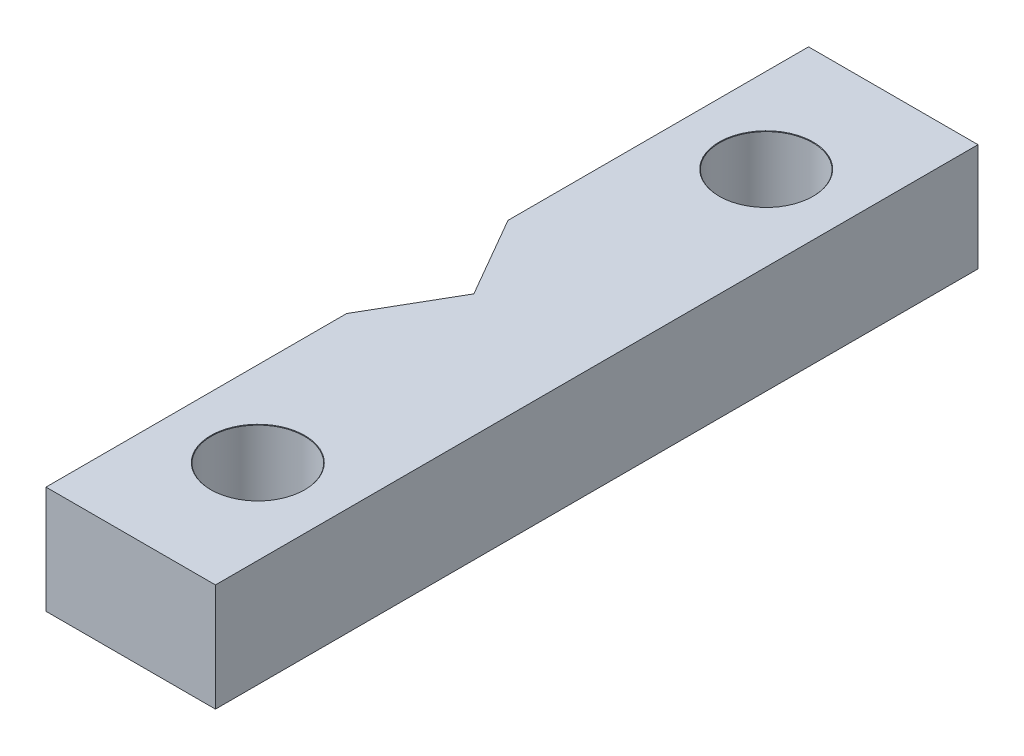
ISO-10303-21;
HEADER;
FILE_DESCRIPTION(('STEP AP214'),'2;1');
FILE_NAME('part.step','',(''),(''),'','','');
FILE_SCHEMA(('AUTOMOTIVE_DESIGN { 1 0 10303 214 1 1 1 1 }'));
ENDSEC;
DATA;
#1=APPLICATION_CONTEXT('core data for automotive mechanical design processes');
#2=APPLICATION_PROTOCOL_DEFINITION('international standard','automotive_design',2000,#1);
#3=PRODUCT_CONTEXT('',#1,'mechanical');
#4=PRODUCT('Part','Part','',(#3));
#5=PRODUCT_RELATED_PRODUCT_CATEGORY('part','',(#4));
#6=PRODUCT_DEFINITION_FORMATION('','',#4);
#7=PRODUCT_DEFINITION_CONTEXT('part definition',#1,'design');
#8=PRODUCT_DEFINITION('design','',#6,#7);
#9=PRODUCT_DEFINITION_SHAPE('','',#8);
#10=(LENGTH_UNIT() NAMED_UNIT(*) SI_UNIT(.MILLI.,.METRE.));
#11=(NAMED_UNIT(*) PLANE_ANGLE_UNIT() SI_UNIT($,.RADIAN.));
#12=(NAMED_UNIT(*) SI_UNIT($,.STERADIAN.) SOLID_ANGLE_UNIT());
#13=UNCERTAINTY_MEASURE_WITH_UNIT(LENGTH_MEASURE(1.E-05),#10,'distance_accuracy_value','');
#14=(GEOMETRIC_REPRESENTATION_CONTEXT(3) GLOBAL_UNCERTAINTY_ASSIGNED_CONTEXT((#13)) GLOBAL_UNIT_ASSIGNED_CONTEXT((#10,
#11,#12)) REPRESENTATION_CONTEXT('',''));
#15=CARTESIAN_POINT('',(0.,0.,0.));
#16=DIRECTION('',(0.,0.,1.));
#17=DIRECTION('',(1.,0.,0.));
#18=AXIS2_PLACEMENT_3D('',#15,#16,#17);
#19=CARTESIAN_POINT('',(10.7493713156446,6.35,0.));
#20=DIRECTION('',(1.,0.,0.));
#21=DIRECTION('',(0.,0.,-1.));
#22=AXIS2_PLACEMENT_3D('',#19,#20,#21);
#23=PLANE('',#22);
#24=DIRECTION('',(0.,0.,1.));
#25=VECTOR('',#24,1.);
#26=CARTESIAN_POINT('',(10.7493713156446,0.,0.));
#27=LINE('',#26,#25);
#28=CARTESIAN_POINT('',(10.7493713156446,0.,-22.5));
#29=VERTEX_POINT('',#28);
#30=CARTESIAN_POINT('',(10.7493713156446,0.,22.5));
#31=VERTEX_POINT('',#30);
#32=EDGE_CURVE('E134',#29,#31,#27,.T.);
#33=ORIENTED_EDGE('',*,*,#32,.F.);
#34=DIRECTION('',(0.,-1.,0.));
#35=VECTOR('',#34,1.);
#36=CARTESIAN_POINT('',(10.7493713156446,6.35,-22.5));
#37=LINE('',#36,#35);
#38=CARTESIAN_POINT('',(10.7493713156446,6.35,-22.5));
#39=VERTEX_POINT('',#38);
#40=EDGE_CURVE('E11',#39,#29,#37,.T.);
#41=ORIENTED_EDGE('',*,*,#40,.F.);
#42=DIRECTION('',(0.,0.,1.));
#43=VECTOR('',#42,1.);
#44=CARTESIAN_POINT('',(10.7493713156446,6.35,0.));
#45=LINE('',#44,#43);
#46=CARTESIAN_POINT('',(10.7493713156446,6.35,22.5));
#47=VERTEX_POINT('',#46);
#48=EDGE_CURVE('E152',#39,#47,#45,.T.);
#49=ORIENTED_EDGE('',*,*,#48,.T.);
#50=DIRECTION('',(0.,-1.,0.));
#51=VECTOR('',#50,1.);
#52=CARTESIAN_POINT('',(10.7493713156446,6.35,22.5));
#53=LINE('',#52,#51);
#54=EDGE_CURVE('E94',#47,#31,#53,.T.);
#55=ORIENTED_EDGE('',*,*,#54,.T.);
#56=EDGE_LOOP('',(#33,#41,#49,#55));
#57=FACE_BOUND('',#56,.T.);
#58=ADVANCED_FACE('F45',(#57),#23,.T.);
#59=CARTESIAN_POINT('',(0.,6.35,-22.5));
#60=DIRECTION('',(0.,0.,-1.));
#61=DIRECTION('',(-1.,0.,0.));
#62=AXIS2_PLACEMENT_3D('',#59,#60,#61);
#63=PLANE('',#62);
#64=DIRECTION('',(1.,0.,0.));
#65=VECTOR('',#64,1.);
#66=CARTESIAN_POINT('',(0.,0.,-22.5));
#67=LINE('',#66,#65);
#68=CARTESIAN_POINT('',(0.749371315644573,0.,-22.5));
#69=VERTEX_POINT('',#68);
#70=EDGE_CURVE('E137',#69,#29,#67,.T.);
#71=ORIENTED_EDGE('',*,*,#70,.F.);
#72=DIRECTION('',(0.,-1.,0.));
#73=VECTOR('',#72,1.);
#74=CARTESIAN_POINT('',(0.749371315644573,6.35,-22.5));
#75=LINE('',#74,#73);
#76=CARTESIAN_POINT('',(0.749371315644573,6.35,-22.5));
#77=VERTEX_POINT('',#76);
#78=EDGE_CURVE('E54',#77,#69,#75,.T.);
#79=ORIENTED_EDGE('',*,*,#78,.F.);
#80=DIRECTION('',(1.,0.,0.));
#81=VECTOR('',#80,1.);
#82=CARTESIAN_POINT('',(0.,6.35,-22.5));
#83=LINE('',#82,#81);
#84=EDGE_CURVE('E172',#77,#39,#83,.T.);
#85=ORIENTED_EDGE('',*,*,#84,.T.);
#86=ORIENTED_EDGE('',*,*,#40,.T.);
#87=EDGE_LOOP('',(#71,#79,#85,#86));
#88=FACE_BOUND('',#87,.T.);
#89=ADVANCED_FACE('F187',(#88),#63,.T.);
#90=CARTESIAN_POINT('',(0.749371315644565,6.35,0.));
#91=DIRECTION('',(-1.,0.,0.));
#92=DIRECTION('',(0.,0.,1.));
#93=AXIS2_PLACEMENT_3D('',#90,#91,#92);
#94=PLANE('',#93);
#95=DIRECTION('',(0.,0.,-1.));
#96=VECTOR('',#95,1.);
#97=CARTESIAN_POINT('',(0.749371315644565,0.,0.));
#98=LINE('',#97,#96);
#99=CARTESIAN_POINT('',(0.749371315644567,0.,-4.76205080756889));
#100=VERTEX_POINT('',#99);
#101=EDGE_CURVE('E141',#100,#69,#98,.T.);
#102=ORIENTED_EDGE('',*,*,#101,.F.);
#103=DIRECTION('',(0.,-1.,0.));
#104=VECTOR('',#103,1.);
#105=CARTESIAN_POINT('',(0.749371315644567,6.35,-4.76205080756889));
#106=LINE('',#105,#104);
#107=CARTESIAN_POINT('',(0.749371315644567,6.35,-4.76205080756889));
#108=VERTEX_POINT('',#107);
#109=EDGE_CURVE('E156',#108,#100,#106,.T.);
#110=ORIENTED_EDGE('',*,*,#109,.F.);
#111=DIRECTION('',(0.,0.,-1.));
#112=VECTOR('',#111,1.);
#113=CARTESIAN_POINT('',(0.749371315644565,6.35,0.));
#114=LINE('',#113,#112);
#115=EDGE_CURVE('E175',#108,#77,#114,.T.);
#116=ORIENTED_EDGE('',*,*,#115,.T.);
#117=ORIENTED_EDGE('',*,*,#78,.T.);
#118=EDGE_LOOP('',(#102,#110,#116,#117));
#119=FACE_BOUND('',#118,.T.);
#120=ADVANCED_FACE('F189',(#119),#94,.T.);
#121=CARTESIAN_POINT('',(2.62405697346685,6.35,-1.515));
#122=DIRECTION('',(-0.866025403784439,0.,0.5));
#123=DIRECTION('',(0.5,0.,0.866025403784439));
#124=AXIS2_PLACEMENT_3D('',#121,#122,#123);
#125=PLANE('',#124);
#126=DIRECTION('',(-0.5,0.,-0.866025403784439));
#127=VECTOR('',#126,1.);
#128=CARTESIAN_POINT('',(2.62405697346685,0.,-1.515));
#129=LINE('',#128,#127);
#130=CARTESIAN_POINT('',(3.49874263128914,0.,0.));
#131=VERTEX_POINT('',#130);
#132=EDGE_CURVE('E144',#131,#100,#129,.T.);
#133=ORIENTED_EDGE('',*,*,#132,.F.);
#134=DIRECTION('',(0.,-1.,0.));
#135=VECTOR('',#134,1.);
#136=CARTESIAN_POINT('',(3.49874263128914,6.35,0.));
#137=LINE('',#136,#135);
#138=CARTESIAN_POINT('',(3.49874263128914,6.35,0.));
#139=VERTEX_POINT('',#138);
#140=EDGE_CURVE('E120',#139,#131,#137,.T.);
#141=ORIENTED_EDGE('',*,*,#140,.F.);
#142=DIRECTION('',(-0.5,0.,-0.866025403784439));
#143=VECTOR('',#142,1.);
#144=CARTESIAN_POINT('',(2.62405697346685,6.35,-1.515));
#145=LINE('',#144,#143);
#146=EDGE_CURVE('E127',#139,#108,#145,.T.);
#147=ORIENTED_EDGE('',*,*,#146,.T.);
#148=ORIENTED_EDGE('',*,*,#109,.T.);
#149=EDGE_LOOP('',(#133,#141,#147,#148));
#150=FACE_BOUND('',#149,.T.);
#151=ADVANCED_FACE('F179',(#150),#125,.T.);
#152=CARTESIAN_POINT('',(2.62405697346685,6.35,1.515));
#153=DIRECTION('',(-0.866025403784438,0.,-0.5));
#154=DIRECTION('',(-0.500000000000001,0.,0.866025403784438));
#155=AXIS2_PLACEMENT_3D('',#152,#153,#154);
#156=PLANE('',#155);
#157=DIRECTION('',(0.5,0.,-0.866025403784438));
#158=VECTOR('',#157,1.);
#159=CARTESIAN_POINT('',(2.62405697346685,0.,1.515));
#160=LINE('',#159,#158);
#161=CARTESIAN_POINT('',(0.749371315644568,0.,4.76205080756889));
#162=VERTEX_POINT('',#161);
#163=EDGE_CURVE('E115',#162,#131,#160,.T.);
#164=ORIENTED_EDGE('',*,*,#163,.F.);
#165=DIRECTION('',(0.,-1.,0.));
#166=VECTOR('',#165,1.);
#167=CARTESIAN_POINT('',(0.749371315644568,6.35,4.76205080756889));
#168=LINE('',#167,#166);
#169=CARTESIAN_POINT('',(0.749371315644568,6.35,4.76205080756889));
#170=VERTEX_POINT('',#169);
#171=EDGE_CURVE('E110',#170,#162,#168,.T.);
#172=ORIENTED_EDGE('',*,*,#171,.F.);
#173=DIRECTION('',(0.5,0.,-0.866025403784438));
#174=VECTOR('',#173,1.);
#175=CARTESIAN_POINT('',(2.62405697346685,6.35,1.515));
#176=LINE('',#175,#174);
#177=EDGE_CURVE('E113',#170,#139,#176,.T.);
#178=ORIENTED_EDGE('',*,*,#177,.T.);
#179=ORIENTED_EDGE('',*,*,#140,.T.);
#180=EDGE_LOOP('',(#164,#172,#178,#179));
#181=FACE_BOUND('',#180,.T.);
#182=ADVANCED_FACE('F112',(#181),#156,.T.);
#183=CARTESIAN_POINT('',(0.749371315644567,6.35,0.));
#184=DIRECTION('',(-1.,0.,0.));
#185=DIRECTION('',(0.,0.,1.));
#186=AXIS2_PLACEMENT_3D('',#183,#184,#185);
#187=PLANE('',#186);
#188=DIRECTION('',(0.,0.,-1.));
#189=VECTOR('',#188,1.);
#190=CARTESIAN_POINT('',(0.749371315644567,0.,0.));
#191=LINE('',#190,#189);
#192=CARTESIAN_POINT('',(0.74937131564457,0.,22.5));
#193=VERTEX_POINT('',#192);
#194=EDGE_CURVE('E148',#193,#162,#191,.T.);
#195=ORIENTED_EDGE('',*,*,#194,.F.);
#196=DIRECTION('',(0.,-1.,0.));
#197=VECTOR('',#196,1.);
#198=CARTESIAN_POINT('',(0.74937131564457,6.35,22.5));
#199=LINE('',#198,#197);
#200=CARTESIAN_POINT('',(0.74937131564457,6.35,22.5));
#201=VERTEX_POINT('',#200);
#202=EDGE_CURVE('E87',#201,#193,#199,.T.);
#203=ORIENTED_EDGE('',*,*,#202,.F.);
#204=DIRECTION('',(0.,0.,-1.));
#205=VECTOR('',#204,1.);
#206=CARTESIAN_POINT('',(0.749371315644567,6.35,0.));
#207=LINE('',#206,#205);
#208=EDGE_CURVE('E124',#201,#170,#207,.T.);
#209=ORIENTED_EDGE('',*,*,#208,.T.);
#210=ORIENTED_EDGE('',*,*,#171,.T.);
#211=EDGE_LOOP('',(#195,#203,#209,#210));
#212=FACE_BOUND('',#211,.T.);
#213=ADVANCED_FACE('F129',(#212),#187,.T.);
#214=CARTESIAN_POINT('',(0.,6.35,22.5));
#215=DIRECTION('',(0.,0.,-1.));
#216=DIRECTION('',(-1.,0.,0.));
#217=AXIS2_PLACEMENT_3D('',#214,#215,#216);
#218=PLANE('',#217);
#219=DIRECTION('',(1.,0.,0.));
#220=VECTOR('',#219,1.);
#221=CARTESIAN_POINT('',(0.,0.,22.5));
#222=LINE('',#221,#220);
#223=EDGE_CURVE('E150',#193,#31,#222,.T.);
#224=ORIENTED_EDGE('',*,*,#223,.T.);
#225=ORIENTED_EDGE('',*,*,#54,.F.);
#226=DIRECTION('',(1.,0.,0.));
#227=VECTOR('',#226,1.);
#228=CARTESIAN_POINT('',(0.,6.35,22.5));
#229=LINE('',#228,#227);
#230=EDGE_CURVE('E63',#201,#47,#229,.T.);
#231=ORIENTED_EDGE('',*,*,#230,.F.);
#232=ORIENTED_EDGE('',*,*,#202,.T.);
#233=EDGE_LOOP('',(#224,#225,#231,#232));
#234=FACE_BOUND('',#233,.T.);
#235=ADVANCED_FACE('F183',(#234),#218,.F.);
#236=CARTESIAN_POINT('',(0.,6.35,0.));
#237=DIRECTION('',(0.,1.,0.));
#238=DIRECTION('',(0.,0.,1.));
#239=AXIS2_PLACEMENT_3D('',#236,#237,#238);
#240=PLANE('',#239);
#241=CARTESIAN_POINT('',(5.74937131564457,6.35,-15.));
#242=DIRECTION('',(0.,1.,0.));
#243=DIRECTION('',(0.,0.,1.));
#244=AXIS2_PLACEMENT_3D('',#241,#242,#243);
#245=CIRCLE('',#244,2.775);
#246=CARTESIAN_POINT('',(5.74937131564457,6.35,-12.225));
#247=VERTEX_POINT('',#246);
#248=EDGE_CURVE('E319',#247,#247,#245,.T.);
#249=ORIENTED_EDGE('',*,*,#248,.F.);
#250=EDGE_LOOP('',(#249));
#251=FACE_BOUND('',#250,.T.);
#252=CARTESIAN_POINT('',(5.74937131564457,6.35,15.));
#253=DIRECTION('',(0.,1.,0.));
#254=DIRECTION('',(0.,0.,1.));
#255=AXIS2_PLACEMENT_3D('',#252,#253,#254);
#256=CIRCLE('',#255,2.775);
#257=CARTESIAN_POINT('',(5.74937131564457,6.35,17.775));
#258=VERTEX_POINT('',#257);
#259=EDGE_CURVE('E163',#258,#258,#256,.T.);
#260=ORIENTED_EDGE('',*,*,#259,.F.);
#261=EDGE_LOOP('',(#260));
#262=FACE_BOUND('',#261,.T.);
#263=ORIENTED_EDGE('',*,*,#48,.F.);
#264=ORIENTED_EDGE('',*,*,#84,.F.);
#265=ORIENTED_EDGE('',*,*,#115,.F.);
#266=ORIENTED_EDGE('',*,*,#146,.F.);
#267=ORIENTED_EDGE('',*,*,#177,.F.);
#268=ORIENTED_EDGE('',*,*,#208,.F.);
#269=ORIENTED_EDGE('',*,*,#230,.T.);
#270=EDGE_LOOP('',(#263,#264,#265,#266,#267,#268,#269));
#271=FACE_BOUND('',#270,.T.);
#272=ADVANCED_FACE('F123',(#251,#262,#271),#240,.T.);
#273=CARTESIAN_POINT('',(0.,0.,0.));
#274=DIRECTION('',(0.,1.,0.));
#275=DIRECTION('',(0.,0.,1.));
#276=AXIS2_PLACEMENT_3D('',#273,#274,#275);
#277=PLANE('',#276);
#278=CARTESIAN_POINT('',(5.74937131564457,0.,-15.));
#279=DIRECTION('',(0.,1.,0.));
#280=DIRECTION('',(0.,0.,1.));
#281=AXIS2_PLACEMENT_3D('',#278,#279,#280);
#282=CIRCLE('',#281,2.75);
#283=CARTESIAN_POINT('',(5.74937131564457,0.,-12.25));
#284=VERTEX_POINT('',#283);
#285=EDGE_CURVE('E48',#284,#284,#282,.T.);
#286=ORIENTED_EDGE('',*,*,#285,.T.);
#287=EDGE_LOOP('',(#286));
#288=FACE_BOUND('',#287,.T.);
#289=CARTESIAN_POINT('',(5.74937131564457,0.,15.));
#290=DIRECTION('',(0.,1.,0.));
#291=DIRECTION('',(0.,0.,1.));
#292=AXIS2_PLACEMENT_3D('',#289,#290,#291);
#293=CIRCLE('',#292,2.75);
#294=CARTESIAN_POINT('',(5.74937131564457,0.,17.75));
#295=VERTEX_POINT('',#294);
#296=EDGE_CURVE('E138',#295,#295,#293,.T.);
#297=ORIENTED_EDGE('',*,*,#296,.T.);
#298=EDGE_LOOP('',(#297));
#299=FACE_BOUND('',#298,.T.);
#300=ORIENTED_EDGE('',*,*,#32,.T.);
#301=ORIENTED_EDGE('',*,*,#223,.F.);
#302=ORIENTED_EDGE('',*,*,#194,.T.);
#303=ORIENTED_EDGE('',*,*,#163,.T.);
#304=ORIENTED_EDGE('',*,*,#132,.T.);
#305=ORIENTED_EDGE('',*,*,#101,.T.);
#306=ORIENTED_EDGE('',*,*,#70,.T.);
#307=EDGE_LOOP('',(#300,#301,#302,#303,#304,#305,#306));
#308=FACE_BOUND('',#307,.T.);
#309=ADVANCED_FACE('F182',(#288,#299,#308),#277,.F.);
#310=CARTESIAN_POINT('',(5.74937131564457,6.35,15.));
#311=DIRECTION('',(0.,1.,0.));
#312=DIRECTION('',(0.,0.,1.));
#313=AXIS2_PLACEMENT_3D('',#310,#311,#312);
#314=CYLINDRICAL_SURFACE('',#313,2.75);
#315=CARTESIAN_POINT('',(5.74937131564457,6.325,15.));
#316=DIRECTION('',(0.,1.,0.));
#317=DIRECTION('',(0.,0.,1.));
#318=AXIS2_PLACEMENT_3D('',#315,#316,#317);
#319=CIRCLE('',#318,2.75);
#320=CARTESIAN_POINT('',(5.74937131564457,6.325,17.75));
#321=VERTEX_POINT('',#320);
#322=EDGE_CURVE('E159',#321,#321,#319,.T.);
#323=ORIENTED_EDGE('',*,*,#322,.T.);
#324=EDGE_LOOP('',(#323));
#325=FACE_BOUND('',#324,.T.);
#326=ORIENTED_EDGE('',*,*,#296,.F.);
#327=EDGE_LOOP('',(#326));
#328=FACE_BOUND('',#327,.T.);
#329=ADVANCED_FACE('F268',(#325,#328),#314,.F.);
#330=CARTESIAN_POINT('',(5.74937131564457,6.35,15.));
#331=DIRECTION('',(0.,1.,0.));
#332=DIRECTION('',(0.,0.,1.));
#333=AXIS2_PLACEMENT_3D('',#330,#331,#332);
#334=CONICAL_SURFACE('',#333,2.775,0.785398163397483);
#335=ORIENTED_EDGE('',*,*,#322,.F.);
#336=EDGE_LOOP('',(#335));
#337=FACE_BOUND('',#336,.T.);
#338=ORIENTED_EDGE('',*,*,#259,.T.);
#339=EDGE_LOOP('',(#338));
#340=FACE_BOUND('',#339,.T.);
#341=ADVANCED_FACE('F281',(#337,#340),#334,.F.);
#342=CARTESIAN_POINT('',(5.74937131564457,6.35,-15.));
#343=DIRECTION('',(0.,1.,0.));
#344=DIRECTION('',(0.,0.,1.));
#345=AXIS2_PLACEMENT_3D('',#342,#343,#344);
#346=CYLINDRICAL_SURFACE('',#345,2.75);
#347=CARTESIAN_POINT('',(5.74937131564457,6.325,-15.));
#348=DIRECTION('',(0.,1.,0.));
#349=DIRECTION('',(0.,0.,1.));
#350=AXIS2_PLACEMENT_3D('',#347,#348,#349);
#351=CIRCLE('',#350,2.75);
#352=CARTESIAN_POINT('',(5.74937131564457,6.325,-12.25));
#353=VERTEX_POINT('',#352);
#354=EDGE_CURVE('E316',#353,#353,#351,.T.);
#355=ORIENTED_EDGE('',*,*,#354,.T.);
#356=EDGE_LOOP('',(#355));
#357=FACE_BOUND('',#356,.T.);
#358=ORIENTED_EDGE('',*,*,#285,.F.);
#359=EDGE_LOOP('',(#358));
#360=FACE_BOUND('',#359,.T.);
#361=ADVANCED_FACE('F290',(#357,#360),#346,.F.);
#362=CARTESIAN_POINT('',(5.74937131564457,6.35,-15.));
#363=DIRECTION('',(0.,1.,0.));
#364=DIRECTION('',(0.,0.,1.));
#365=AXIS2_PLACEMENT_3D('',#362,#363,#364);
#366=CONICAL_SURFACE('',#365,2.775,0.785398163397483);
#367=ORIENTED_EDGE('',*,*,#354,.F.);
#368=EDGE_LOOP('',(#367));
#369=FACE_BOUND('',#368,.T.);
#370=ORIENTED_EDGE('',*,*,#248,.T.);
#371=EDGE_LOOP('',(#370));
#372=FACE_BOUND('',#371,.T.);
#373=ADVANCED_FACE('F300',(#369,#372),#366,.F.);
#374=CLOSED_SHELL('',(#58,#89,#120,#151,#182,#213,#235,#272,#309,#329,#341,#361,#373));
#375=MANIFOLD_SOLID_BREP('B2',#374);
#376=ADVANCED_BREP_SHAPE_REPRESENTATION('',(#18,#375),#14);
#377=SHAPE_DEFINITION_REPRESENTATION(#9,#376);
ENDSEC;
END-ISO-10303-21;
